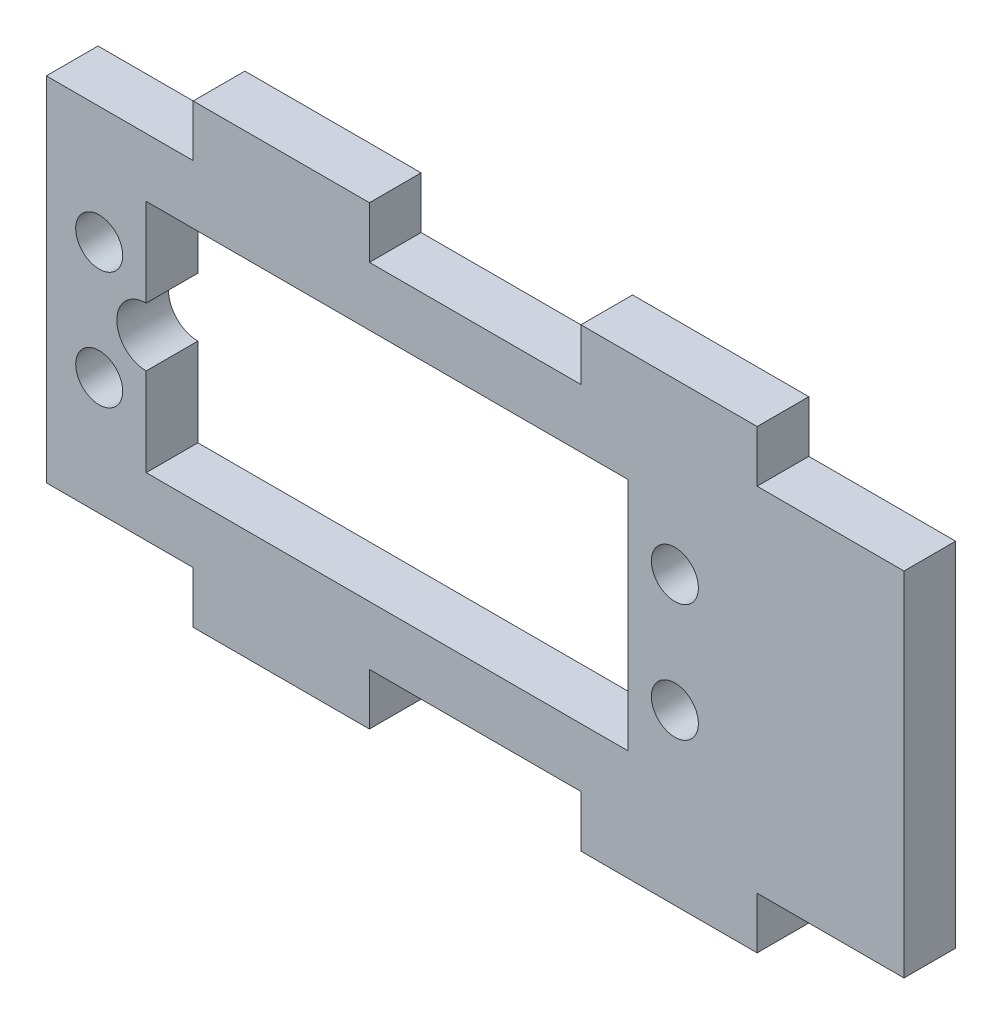
ISO-10303-21;
HEADER;
FILE_DESCRIPTION(('STEP AP214'),'2;1');
FILE_NAME('part.step','',(''),(''),'','','');
FILE_SCHEMA(('AUTOMOTIVE_DESIGN { 1 0 10303 214 1 1 1 1 }'));
ENDSEC;
DATA;
#1=APPLICATION_CONTEXT('core data for automotive mechanical design processes');
#2=APPLICATION_PROTOCOL_DEFINITION('international standard','automotive_design',2000,#1);
#3=PRODUCT_CONTEXT('',#1,'mechanical');
#4=PRODUCT('Part','Part','',(#3));
#5=PRODUCT_RELATED_PRODUCT_CATEGORY('part','',(#4));
#6=PRODUCT_DEFINITION_FORMATION('','',#4);
#7=PRODUCT_DEFINITION_CONTEXT('part definition',#1,'design');
#8=PRODUCT_DEFINITION('design','',#6,#7);
#9=PRODUCT_DEFINITION_SHAPE('','',#8);
#10=(LENGTH_UNIT() NAMED_UNIT(*) SI_UNIT(.MILLI.,.METRE.));
#11=(NAMED_UNIT(*) PLANE_ANGLE_UNIT() SI_UNIT($,.RADIAN.));
#12=(NAMED_UNIT(*) SI_UNIT($,.STERADIAN.) SOLID_ANGLE_UNIT());
#13=UNCERTAINTY_MEASURE_WITH_UNIT(LENGTH_MEASURE(1.E-05),#10,'distance_accuracy_value','');
#14=(GEOMETRIC_REPRESENTATION_CONTEXT(3) GLOBAL_UNCERTAINTY_ASSIGNED_CONTEXT((#13)) GLOBAL_UNIT_ASSIGNED_CONTEXT((#10,
#11,#12)) REPRESENTATION_CONTEXT('',''));
#15=CARTESIAN_POINT('',(0.,0.,0.));
#16=DIRECTION('',(0.,0.,1.));
#17=DIRECTION('',(1.,0.,0.));
#18=AXIS2_PLACEMENT_3D('',#15,#16,#17);
#19=CARTESIAN_POINT('',(-28.,9.99999999999999,4.4));
#20=DIRECTION('',(1.,0.,0.));
#21=DIRECTION('',(0.,1.,0.));
#22=AXIS2_PLACEMENT_3D('',#19,#20,#21);
#23=PLANE('',#22);
#24=DIRECTION('',(0.,0.,1.));
#25=VECTOR('',#24,1.);
#26=CARTESIAN_POINT('',(-28.,2.5,0.));
#27=LINE('',#26,#25);
#28=CARTESIAN_POINT('',(-28.,2.5,0.));
#29=VERTEX_POINT('',#28);
#30=CARTESIAN_POINT('',(-28.,2.5,4.4));
#31=VERTEX_POINT('',#30);
#32=EDGE_CURVE('E11',#29,#31,#27,.T.);
#33=ORIENTED_EDGE('',*,*,#32,.F.);
#34=DIRECTION('',(0.,-1.,0.));
#35=VECTOR('',#34,1.);
#36=CARTESIAN_POINT('',(-28.,9.99999999999999,0.));
#37=LINE('',#36,#35);
#38=CARTESIAN_POINT('',(-28.,9.99999999999999,0.));
#39=VERTEX_POINT('',#38);
#40=EDGE_CURVE('E236',#39,#29,#37,.T.);
#41=ORIENTED_EDGE('',*,*,#40,.F.);
#42=DIRECTION('',(0.,0.,-1.));
#43=VECTOR('',#42,1.);
#44=CARTESIAN_POINT('',(-28.,9.99999999999999,4.4));
#45=LINE('',#44,#43);
#46=CARTESIAN_POINT('',(-28.,9.99999999999999,4.4));
#47=VERTEX_POINT('',#46);
#48=EDGE_CURVE('E223',#47,#39,#45,.T.);
#49=ORIENTED_EDGE('',*,*,#48,.F.);
#50=DIRECTION('',(0.,-1.,0.));
#51=VECTOR('',#50,1.);
#52=CARTESIAN_POINT('',(-28.,9.99999999999999,4.4));
#53=LINE('',#52,#51);
#54=EDGE_CURVE('E217',#47,#31,#53,.T.);
#55=ORIENTED_EDGE('',*,*,#54,.T.);
#56=EDGE_LOOP('',(#33,#41,#49,#55));
#57=FACE_BOUND('',#56,.T.);
#58=ADVANCED_FACE('F35',(#57),#23,.T.);
#59=CARTESIAN_POINT('',(0.,0.,4.4));
#60=DIRECTION('',(0.,0.,-1.));
#61=DIRECTION('',(-1.,0.,0.));
#62=AXIS2_PLACEMENT_3D('',#59,#60,#61);
#63=PLANE('',#62);
#64=DIRECTION('',(0.,1.,0.));
#65=VECTOR('',#64,1.);
#66=CARTESIAN_POINT('',(-9.,-15.,4.4));
#67=LINE('',#66,#65);
#68=CARTESIAN_POINT('',(-9.,-19.4,4.4));
#69=VERTEX_POINT('',#68);
#70=CARTESIAN_POINT('',(-9.,-15.,4.4));
#71=VERTEX_POINT('',#70);
#72=EDGE_CURVE('E255',#69,#71,#67,.T.);
#73=ORIENTED_EDGE('',*,*,#72,.T.);
#74=DIRECTION('',(1.,0.,0.));
#75=VECTOR('',#74,1.);
#76=CARTESIAN_POINT('',(-9.,-15.,4.4));
#77=LINE('',#76,#75);
#78=CARTESIAN_POINT('',(9.,-15.,4.4));
#79=VERTEX_POINT('',#78);
#80=EDGE_CURVE('E258',#71,#79,#77,.T.);
#81=ORIENTED_EDGE('',*,*,#80,.T.);
#82=DIRECTION('',(0.,-1.,0.));
#83=VECTOR('',#82,1.);
#84=CARTESIAN_POINT('',(9.,-15.,4.4));
#85=LINE('',#84,#83);
#86=CARTESIAN_POINT('',(9.,-19.4,4.4));
#87=VERTEX_POINT('',#86);
#88=EDGE_CURVE('E261',#79,#87,#85,.T.);
#89=ORIENTED_EDGE('',*,*,#88,.T.);
#90=DIRECTION('',(1.,0.,0.));
#91=VECTOR('',#90,1.);
#92=CARTESIAN_POINT('',(9.,-19.4,4.4));
#93=LINE('',#92,#91);
#94=CARTESIAN_POINT('',(24.,-19.4,4.4));
#95=VERTEX_POINT('',#94);
#96=EDGE_CURVE('E263',#87,#95,#93,.T.);
#97=ORIENTED_EDGE('',*,*,#96,.T.);
#98=DIRECTION('',(0.,1.,0.));
#99=VECTOR('',#98,1.);
#100=CARTESIAN_POINT('',(24.,-19.4,4.4));
#101=LINE('',#100,#99);
#102=CARTESIAN_POINT('',(24.,-15.,4.4));
#103=VERTEX_POINT('',#102);
#104=EDGE_CURVE('E265',#95,#103,#101,.T.);
#105=ORIENTED_EDGE('',*,*,#104,.T.);
#106=DIRECTION('',(1.,0.,0.));
#107=VECTOR('',#106,1.);
#108=CARTESIAN_POINT('',(24.,-15.,4.4));
#109=LINE('',#108,#107);
#110=CARTESIAN_POINT('',(36.5,-15.,4.4));
#111=VERTEX_POINT('',#110);
#112=EDGE_CURVE('E267',#103,#111,#109,.T.);
#113=ORIENTED_EDGE('',*,*,#112,.T.);
#114=DIRECTION('',(0.,1.,0.));
#115=VECTOR('',#114,1.);
#116=CARTESIAN_POINT('',(36.5,-15.,4.4));
#117=LINE('',#116,#115);
#118=CARTESIAN_POINT('',(36.5,15.,4.4));
#119=VERTEX_POINT('',#118);
#120=EDGE_CURVE('E269',#111,#119,#117,.T.);
#121=ORIENTED_EDGE('',*,*,#120,.T.);
#122=DIRECTION('',(-1.,0.,0.));
#123=VECTOR('',#122,1.);
#124=CARTESIAN_POINT('',(24.,15.,4.4));
#125=LINE('',#124,#123);
#126=CARTESIAN_POINT('',(24.,15.,4.4));
#127=VERTEX_POINT('',#126);
#128=EDGE_CURVE('E271',#119,#127,#125,.T.);
#129=ORIENTED_EDGE('',*,*,#128,.T.);
#130=DIRECTION('',(0.,1.,0.));
#131=VECTOR('',#130,1.);
#132=CARTESIAN_POINT('',(24.,19.4,4.4));
#133=LINE('',#132,#131);
#134=CARTESIAN_POINT('',(24.,19.4,4.4));
#135=VERTEX_POINT('',#134);
#136=EDGE_CURVE('E273',#127,#135,#133,.T.);
#137=ORIENTED_EDGE('',*,*,#136,.T.);
#138=DIRECTION('',(-1.,0.,0.));
#139=VECTOR('',#138,1.);
#140=CARTESIAN_POINT('',(9.,19.4,4.4));
#141=LINE('',#140,#139);
#142=CARTESIAN_POINT('',(9.,19.4,4.4));
#143=VERTEX_POINT('',#142);
#144=EDGE_CURVE('E275',#135,#143,#141,.T.);
#145=ORIENTED_EDGE('',*,*,#144,.T.);
#146=DIRECTION('',(0.,-1.,0.));
#147=VECTOR('',#146,1.);
#148=CARTESIAN_POINT('',(9.,15.,4.4));
#149=LINE('',#148,#147);
#150=CARTESIAN_POINT('',(9.,15.,4.4));
#151=VERTEX_POINT('',#150);
#152=EDGE_CURVE('E277',#143,#151,#149,.T.);
#153=ORIENTED_EDGE('',*,*,#152,.T.);
#154=DIRECTION('',(-1.,0.,0.));
#155=VECTOR('',#154,1.);
#156=CARTESIAN_POINT('',(-9.,15.,4.4));
#157=LINE('',#156,#155);
#158=CARTESIAN_POINT('',(-9.,15.,4.4));
#159=VERTEX_POINT('',#158);
#160=EDGE_CURVE('E279',#151,#159,#157,.T.);
#161=ORIENTED_EDGE('',*,*,#160,.T.);
#162=DIRECTION('',(0.,1.,0.));
#163=VECTOR('',#162,1.);
#164=CARTESIAN_POINT('',(-9.,15.,4.4));
#165=LINE('',#164,#163);
#166=CARTESIAN_POINT('',(-9.,19.4,4.4));
#167=VERTEX_POINT('',#166);
#168=EDGE_CURVE('E281',#159,#167,#165,.T.);
#169=ORIENTED_EDGE('',*,*,#168,.T.);
#170=DIRECTION('',(-1.,0.,0.));
#171=VECTOR('',#170,1.);
#172=CARTESIAN_POINT('',(-9.,19.4,4.4));
#173=LINE('',#172,#171);
#174=CARTESIAN_POINT('',(-24.,19.4,4.4));
#175=VERTEX_POINT('',#174);
#176=EDGE_CURVE('E283',#167,#175,#173,.T.);
#177=ORIENTED_EDGE('',*,*,#176,.T.);
#178=DIRECTION('',(0.,-1.,0.));
#179=VECTOR('',#178,1.);
#180=CARTESIAN_POINT('',(-24.,19.4,4.4));
#181=LINE('',#180,#179);
#182=CARTESIAN_POINT('',(-24.,15.,4.4));
#183=VERTEX_POINT('',#182);
#184=EDGE_CURVE('E285',#175,#183,#181,.T.);
#185=ORIENTED_EDGE('',*,*,#184,.T.);
#186=DIRECTION('',(-1.,0.,0.));
#187=VECTOR('',#186,1.);
#188=CARTESIAN_POINT('',(-24.,15.,4.4));
#189=LINE('',#188,#187);
#190=CARTESIAN_POINT('',(-36.5,15.,4.4));
#191=VERTEX_POINT('',#190);
#192=EDGE_CURVE('E287',#183,#191,#189,.T.);
#193=ORIENTED_EDGE('',*,*,#192,.T.);
#194=DIRECTION('',(0.,-1.,0.));
#195=VECTOR('',#194,1.);
#196=CARTESIAN_POINT('',(-36.5,-15.,4.4));
#197=LINE('',#196,#195);
#198=CARTESIAN_POINT('',(-36.5,-15.,4.4));
#199=VERTEX_POINT('',#198);
#200=EDGE_CURVE('E289',#191,#199,#197,.T.);
#201=ORIENTED_EDGE('',*,*,#200,.T.);
#202=DIRECTION('',(1.,0.,0.));
#203=VECTOR('',#202,1.);
#204=CARTESIAN_POINT('',(-24.,-15.,4.4));
#205=LINE('',#204,#203);
#206=CARTESIAN_POINT('',(-24.,-15.,4.4));
#207=VERTEX_POINT('',#206);
#208=EDGE_CURVE('E291',#199,#207,#205,.T.);
#209=ORIENTED_EDGE('',*,*,#208,.T.);
#210=DIRECTION('',(0.,-1.,0.));
#211=VECTOR('',#210,1.);
#212=CARTESIAN_POINT('',(-24.,-19.4,4.4));
#213=LINE('',#212,#211);
#214=CARTESIAN_POINT('',(-24.,-19.4,4.4));
#215=VERTEX_POINT('',#214);
#216=EDGE_CURVE('E293',#207,#215,#213,.T.);
#217=ORIENTED_EDGE('',*,*,#216,.T.);
#218=DIRECTION('',(1.,0.,0.));
#219=VECTOR('',#218,1.);
#220=CARTESIAN_POINT('',(-9.,-19.4,4.4));
#221=LINE('',#220,#219);
#222=EDGE_CURVE('E295',#215,#69,#221,.T.);
#223=ORIENTED_EDGE('',*,*,#222,.T.);
#224=EDGE_LOOP('',(#73,#81,#89,#97,#105,#113,#121,#129,#137,#145,#153,#161,#169,#177,#185,#193,
#201,#209,#217,#223));
#225=FACE_BOUND('',#224,.T.);
#226=CARTESIAN_POINT('',(-28.,-2.5,4.4));
#227=VERTEX_POINT('',#226);
#228=CARTESIAN_POINT('',(-28.,-10.,4.4));
#229=VERTEX_POINT('',#228);
#230=EDGE_CURVE('E219',#227,#229,#53,.T.);
#231=ORIENTED_EDGE('',*,*,#230,.F.);
#232=CARTESIAN_POINT('',(-28.,0.,4.4));
#233=DIRECTION('',(0.,0.,1.));
#234=DIRECTION('',(1.,0.,0.));
#235=AXIS2_PLACEMENT_3D('',#232,#233,#234);
#236=CIRCLE('',#235,2.5);
#237=EDGE_CURVE('E49',#31,#227,#236,.T.);
#238=ORIENTED_EDGE('',*,*,#237,.F.);
#239=ORIENTED_EDGE('',*,*,#54,.F.);
#240=DIRECTION('',(-1.,0.,0.));
#241=VECTOR('',#240,1.);
#242=CARTESIAN_POINT('',(13.,10.,4.4));
#243=LINE('',#242,#241);
#244=CARTESIAN_POINT('',(13.,10.,4.4));
#245=VERTEX_POINT('',#244);
#246=EDGE_CURVE('E234',#245,#47,#243,.T.);
#247=ORIENTED_EDGE('',*,*,#246,.F.);
#248=DIRECTION('',(0.,1.,0.));
#249=VECTOR('',#248,1.);
#250=CARTESIAN_POINT('',(13.,10.,4.4));
#251=LINE('',#250,#249);
#252=CARTESIAN_POINT('',(13.,-10.,4.4));
#253=VERTEX_POINT('',#252);
#254=EDGE_CURVE('E226',#253,#245,#251,.T.);
#255=ORIENTED_EDGE('',*,*,#254,.F.);
#256=DIRECTION('',(1.,0.,0.));
#257=VECTOR('',#256,1.);
#258=CARTESIAN_POINT('',(13.,-10.,4.4));
#259=LINE('',#258,#257);
#260=EDGE_CURVE('E224',#229,#253,#259,.T.);
#261=ORIENTED_EDGE('',*,*,#260,.F.);
#262=EDGE_LOOP('',(#231,#238,#239,#247,#255,#261));
#263=FACE_BOUND('',#262,.T.);
#264=CARTESIAN_POINT('',(-32.,5.,4.4));
#265=DIRECTION('',(0.,0.,1.));
#266=DIRECTION('',(1.,0.,0.));
#267=AXIS2_PLACEMENT_3D('',#264,#265,#266);
#268=CIRCLE('',#267,2.);
#269=CARTESIAN_POINT('',(-30.,5.,4.4));
#270=VERTEX_POINT('',#269);
#271=EDGE_CURVE('E405',#270,#270,#268,.T.);
#272=ORIENTED_EDGE('',*,*,#271,.F.);
#273=EDGE_LOOP('',(#272));
#274=FACE_BOUND('',#273,.T.);
#275=CARTESIAN_POINT('',(-32.,-5.,4.4));
#276=DIRECTION('',(0.,0.,1.));
#277=DIRECTION('',(-1.,0.,0.));
#278=AXIS2_PLACEMENT_3D('',#275,#276,#277);
#279=CIRCLE('',#278,2.);
#280=CARTESIAN_POINT('',(-34.,-5.,4.4));
#281=VERTEX_POINT('',#280);
#282=EDGE_CURVE('E410',#281,#281,#279,.T.);
#283=ORIENTED_EDGE('',*,*,#282,.F.);
#284=EDGE_LOOP('',(#283));
#285=FACE_BOUND('',#284,.T.);
#286=CARTESIAN_POINT('',(17.,-4.99999999999999,4.4));
#287=DIRECTION('',(0.,0.,1.));
#288=DIRECTION('',(1.,0.,0.));
#289=AXIS2_PLACEMENT_3D('',#286,#287,#288);
#290=CIRCLE('',#289,2.);
#291=CARTESIAN_POINT('',(19.,-4.99999999999999,4.4));
#292=VERTEX_POINT('',#291);
#293=EDGE_CURVE('E415',#292,#292,#290,.T.);
#294=ORIENTED_EDGE('',*,*,#293,.F.);
#295=EDGE_LOOP('',(#294));
#296=FACE_BOUND('',#295,.T.);
#297=CARTESIAN_POINT('',(17.,4.99999999999999,4.4));
#298=DIRECTION('',(0.,0.,1.));
#299=DIRECTION('',(-1.,0.,0.));
#300=AXIS2_PLACEMENT_3D('',#297,#298,#299);
#301=CIRCLE('',#300,2.);
#302=CARTESIAN_POINT('',(15.,4.99999999999999,4.4));
#303=VERTEX_POINT('',#302);
#304=EDGE_CURVE('E421',#303,#303,#301,.T.);
#305=ORIENTED_EDGE('',*,*,#304,.F.);
#306=EDGE_LOOP('',(#305));
#307=FACE_BOUND('',#306,.T.);
#308=ADVANCED_FACE('F214',(#225,#263,#274,#285,#296,#307),#63,.F.);
#309=CARTESIAN_POINT('',(0.,0.,0.));
#310=DIRECTION('',(0.,0.,-1.));
#311=DIRECTION('',(-1.,0.,0.));
#312=AXIS2_PLACEMENT_3D('',#309,#310,#311);
#313=PLANE('',#312);
#314=CARTESIAN_POINT('',(-28.,0.,0.));
#315=DIRECTION('',(0.,0.,1.));
#316=DIRECTION('',(1.,0.,0.));
#317=AXIS2_PLACEMENT_3D('',#314,#315,#316);
#318=CIRCLE('',#317,2.5);
#319=CARTESIAN_POINT('',(-28.,-2.5,0.));
#320=VERTEX_POINT('',#319);
#321=EDGE_CURVE('E207',#29,#320,#318,.T.);
#322=ORIENTED_EDGE('',*,*,#321,.T.);
#323=CARTESIAN_POINT('',(-28.,-10.,0.));
#324=VERTEX_POINT('',#323);
#325=EDGE_CURVE('E239',#320,#324,#37,.T.);
#326=ORIENTED_EDGE('',*,*,#325,.T.);
#327=DIRECTION('',(1.,0.,0.));
#328=VECTOR('',#327,1.);
#329=CARTESIAN_POINT('',(13.,-10.,0.));
#330=LINE('',#329,#328);
#331=CARTESIAN_POINT('',(13.,-10.,0.));
#332=VERTEX_POINT('',#331);
#333=EDGE_CURVE('E238',#324,#332,#330,.T.);
#334=ORIENTED_EDGE('',*,*,#333,.T.);
#335=DIRECTION('',(0.,1.,0.));
#336=VECTOR('',#335,1.);
#337=CARTESIAN_POINT('',(13.,10.,0.));
#338=LINE('',#337,#336);
#339=CARTESIAN_POINT('',(13.,10.,0.));
#340=VERTEX_POINT('',#339);
#341=EDGE_CURVE('E242',#332,#340,#338,.T.);
#342=ORIENTED_EDGE('',*,*,#341,.T.);
#343=DIRECTION('',(-1.,0.,0.));
#344=VECTOR('',#343,1.);
#345=CARTESIAN_POINT('',(13.,10.,0.));
#346=LINE('',#345,#344);
#347=EDGE_CURVE('E228',#340,#39,#346,.T.);
#348=ORIENTED_EDGE('',*,*,#347,.T.);
#349=ORIENTED_EDGE('',*,*,#40,.T.);
#350=EDGE_LOOP('',(#322,#326,#334,#342,#348,#349));
#351=FACE_BOUND('',#350,.T.);
#352=CARTESIAN_POINT('',(17.,-4.99999999999999,0.));
#353=DIRECTION('',(0.,0.,1.));
#354=DIRECTION('',(1.,0.,0.));
#355=AXIS2_PLACEMENT_3D('',#352,#353,#354);
#356=CIRCLE('',#355,2.);
#357=CARTESIAN_POINT('',(19.,-4.99999999999999,0.));
#358=VERTEX_POINT('',#357);
#359=EDGE_CURVE('E418',#358,#358,#356,.T.);
#360=ORIENTED_EDGE('',*,*,#359,.T.);
#361=EDGE_LOOP('',(#360));
#362=FACE_BOUND('',#361,.T.);
#363=CARTESIAN_POINT('',(-32.,5.,0.));
#364=DIRECTION('',(0.,0.,1.));
#365=DIRECTION('',(1.,0.,0.));
#366=AXIS2_PLACEMENT_3D('',#363,#364,#365);
#367=CIRCLE('',#366,2.);
#368=CARTESIAN_POINT('',(-30.,5.,0.));
#369=VERTEX_POINT('',#368);
#370=EDGE_CURVE('E230',#369,#369,#367,.T.);
#371=ORIENTED_EDGE('',*,*,#370,.T.);
#372=EDGE_LOOP('',(#371));
#373=FACE_BOUND('',#372,.T.);
#374=DIRECTION('',(0.,1.,0.));
#375=VECTOR('',#374,1.);
#376=CARTESIAN_POINT('',(-9.,-15.,0.));
#377=LINE('',#376,#375);
#378=CARTESIAN_POINT('',(-9.,-19.4,0.));
#379=VERTEX_POINT('',#378);
#380=CARTESIAN_POINT('',(-9.,-15.,0.));
#381=VERTEX_POINT('',#380);
#382=EDGE_CURVE('E254',#379,#381,#377,.T.);
#383=ORIENTED_EDGE('',*,*,#382,.F.);
#384=DIRECTION('',(1.,0.,0.));
#385=VECTOR('',#384,1.);
#386=CARTESIAN_POINT('',(-9.,-19.4,0.));
#387=LINE('',#386,#385);
#388=CARTESIAN_POINT('',(-24.,-19.4,0.));
#389=VERTEX_POINT('',#388);
#390=EDGE_CURVE('E259',#389,#379,#387,.T.);
#391=ORIENTED_EDGE('',*,*,#390,.F.);
#392=DIRECTION('',(0.,-1.,0.));
#393=VECTOR('',#392,1.);
#394=CARTESIAN_POINT('',(-24.,-19.4,0.));
#395=LINE('',#394,#393);
#396=CARTESIAN_POINT('',(-24.,-15.,0.));
#397=VERTEX_POINT('',#396);
#398=EDGE_CURVE('E334',#397,#389,#395,.T.);
#399=ORIENTED_EDGE('',*,*,#398,.F.);
#400=DIRECTION('',(1.,0.,0.));
#401=VECTOR('',#400,1.);
#402=CARTESIAN_POINT('',(-24.,-15.,0.));
#403=LINE('',#402,#401);
#404=CARTESIAN_POINT('',(-36.5,-15.,0.));
#405=VERTEX_POINT('',#404);
#406=EDGE_CURVE('E332',#405,#397,#403,.T.);
#407=ORIENTED_EDGE('',*,*,#406,.F.);
#408=DIRECTION('',(0.,-1.,0.));
#409=VECTOR('',#408,1.);
#410=CARTESIAN_POINT('',(-36.5,-15.,0.));
#411=LINE('',#410,#409);
#412=CARTESIAN_POINT('',(-36.5,15.,0.));
#413=VERTEX_POINT('',#412);
#414=EDGE_CURVE('E330',#413,#405,#411,.T.);
#415=ORIENTED_EDGE('',*,*,#414,.F.);
#416=DIRECTION('',(-1.,0.,0.));
#417=VECTOR('',#416,1.);
#418=CARTESIAN_POINT('',(-24.,15.,0.));
#419=LINE('',#418,#417);
#420=CARTESIAN_POINT('',(-24.,15.,0.));
#421=VERTEX_POINT('',#420);
#422=EDGE_CURVE('E328',#421,#413,#419,.T.);
#423=ORIENTED_EDGE('',*,*,#422,.F.);
#424=DIRECTION('',(0.,-1.,0.));
#425=VECTOR('',#424,1.);
#426=CARTESIAN_POINT('',(-24.,19.4,0.));
#427=LINE('',#426,#425);
#428=CARTESIAN_POINT('',(-24.,19.4,0.));
#429=VERTEX_POINT('',#428);
#430=EDGE_CURVE('E326',#429,#421,#427,.T.);
#431=ORIENTED_EDGE('',*,*,#430,.F.);
#432=DIRECTION('',(-1.,0.,0.));
#433=VECTOR('',#432,1.);
#434=CARTESIAN_POINT('',(-9.,19.4,0.));
#435=LINE('',#434,#433);
#436=CARTESIAN_POINT('',(-9.,19.4,0.));
#437=VERTEX_POINT('',#436);
#438=EDGE_CURVE('E324',#437,#429,#435,.T.);
#439=ORIENTED_EDGE('',*,*,#438,.F.);
#440=DIRECTION('',(0.,1.,0.));
#441=VECTOR('',#440,1.);
#442=CARTESIAN_POINT('',(-9.,15.,0.));
#443=LINE('',#442,#441);
#444=CARTESIAN_POINT('',(-9.,15.,0.));
#445=VERTEX_POINT('',#444);
#446=EDGE_CURVE('E322',#445,#437,#443,.T.);
#447=ORIENTED_EDGE('',*,*,#446,.F.);
#448=DIRECTION('',(-1.,0.,0.));
#449=VECTOR('',#448,1.);
#450=CARTESIAN_POINT('',(-9.,15.,0.));
#451=LINE('',#450,#449);
#452=CARTESIAN_POINT('',(9.,15.,0.));
#453=VERTEX_POINT('',#452);
#454=EDGE_CURVE('E320',#453,#445,#451,.T.);
#455=ORIENTED_EDGE('',*,*,#454,.F.);
#456=DIRECTION('',(0.,-1.,0.));
#457=VECTOR('',#456,1.);
#458=CARTESIAN_POINT('',(9.,15.,0.));
#459=LINE('',#458,#457);
#460=CARTESIAN_POINT('',(9.,19.4,0.));
#461=VERTEX_POINT('',#460);
#462=EDGE_CURVE('E318',#461,#453,#459,.T.);
#463=ORIENTED_EDGE('',*,*,#462,.F.);
#464=DIRECTION('',(-1.,0.,0.));
#465=VECTOR('',#464,1.);
#466=CARTESIAN_POINT('',(9.,19.4,0.));
#467=LINE('',#466,#465);
#468=CARTESIAN_POINT('',(24.,19.4,0.));
#469=VERTEX_POINT('',#468);
#470=EDGE_CURVE('E316',#469,#461,#467,.T.);
#471=ORIENTED_EDGE('',*,*,#470,.F.);
#472=DIRECTION('',(0.,1.,0.));
#473=VECTOR('',#472,1.);
#474=CARTESIAN_POINT('',(24.,19.4,0.));
#475=LINE('',#474,#473);
#476=CARTESIAN_POINT('',(24.,15.,0.));
#477=VERTEX_POINT('',#476);
#478=EDGE_CURVE('E314',#477,#469,#475,.T.);
#479=ORIENTED_EDGE('',*,*,#478,.F.);
#480=DIRECTION('',(-1.,0.,0.));
#481=VECTOR('',#480,1.);
#482=CARTESIAN_POINT('',(24.,15.,0.));
#483=LINE('',#482,#481);
#484=CARTESIAN_POINT('',(36.5,15.,0.));
#485=VERTEX_POINT('',#484);
#486=EDGE_CURVE('E312',#485,#477,#483,.T.);
#487=ORIENTED_EDGE('',*,*,#486,.F.);
#488=DIRECTION('',(0.,1.,0.));
#489=VECTOR('',#488,1.);
#490=CARTESIAN_POINT('',(36.5,-15.,0.));
#491=LINE('',#490,#489);
#492=CARTESIAN_POINT('',(36.5,-15.,0.));
#493=VERTEX_POINT('',#492);
#494=EDGE_CURVE('E310',#493,#485,#491,.T.);
#495=ORIENTED_EDGE('',*,*,#494,.F.);
#496=DIRECTION('',(1.,0.,0.));
#497=VECTOR('',#496,1.);
#498=CARTESIAN_POINT('',(24.,-15.,0.));
#499=LINE('',#498,#497);
#500=CARTESIAN_POINT('',(24.,-15.,0.));
#501=VERTEX_POINT('',#500);
#502=EDGE_CURVE('E308',#501,#493,#499,.T.);
#503=ORIENTED_EDGE('',*,*,#502,.F.);
#504=DIRECTION('',(0.,1.,0.));
#505=VECTOR('',#504,1.);
#506=CARTESIAN_POINT('',(24.,-19.4,0.));
#507=LINE('',#506,#505);
#508=CARTESIAN_POINT('',(24.,-19.4,0.));
#509=VERTEX_POINT('',#508);
#510=EDGE_CURVE('E306',#509,#501,#507,.T.);
#511=ORIENTED_EDGE('',*,*,#510,.F.);
#512=DIRECTION('',(1.,0.,0.));
#513=VECTOR('',#512,1.);
#514=CARTESIAN_POINT('',(9.,-19.4,0.));
#515=LINE('',#514,#513);
#516=CARTESIAN_POINT('',(9.,-19.4,0.));
#517=VERTEX_POINT('',#516);
#518=EDGE_CURVE('E304',#517,#509,#515,.T.);
#519=ORIENTED_EDGE('',*,*,#518,.F.);
#520=DIRECTION('',(0.,-1.,0.));
#521=VECTOR('',#520,1.);
#522=CARTESIAN_POINT('',(9.,-15.,0.));
#523=LINE('',#522,#521);
#524=CARTESIAN_POINT('',(9.,-15.,0.));
#525=VERTEX_POINT('',#524);
#526=EDGE_CURVE('E302',#525,#517,#523,.T.);
#527=ORIENTED_EDGE('',*,*,#526,.F.);
#528=DIRECTION('',(1.,0.,0.));
#529=VECTOR('',#528,1.);
#530=CARTESIAN_POINT('',(-9.,-15.,0.));
#531=LINE('',#530,#529);
#532=EDGE_CURVE('E300',#381,#525,#531,.T.);
#533=ORIENTED_EDGE('',*,*,#532,.F.);
#534=EDGE_LOOP('',(#383,#391,#399,#407,#415,#423,#431,#439,#447,#455,#463,#471,#479,#487,#495,
#503,#511,#519,#527,#533));
#535=FACE_BOUND('',#534,.T.);
#536=CARTESIAN_POINT('',(-32.,-5.,0.));
#537=DIRECTION('',(0.,0.,1.));
#538=DIRECTION('',(-1.,0.,0.));
#539=AXIS2_PLACEMENT_3D('',#536,#537,#538);
#540=CIRCLE('',#539,2.);
#541=CARTESIAN_POINT('',(-34.,-5.,0.));
#542=VERTEX_POINT('',#541);
#543=EDGE_CURVE('E412',#542,#542,#540,.T.);
#544=ORIENTED_EDGE('',*,*,#543,.T.);
#545=EDGE_LOOP('',(#544));
#546=FACE_BOUND('',#545,.T.);
#547=CARTESIAN_POINT('',(17.,4.99999999999999,0.));
#548=DIRECTION('',(0.,0.,1.));
#549=DIRECTION('',(-1.,0.,0.));
#550=AXIS2_PLACEMENT_3D('',#547,#548,#549);
#551=CIRCLE('',#550,2.);
#552=CARTESIAN_POINT('',(15.,4.99999999999999,0.));
#553=VERTEX_POINT('',#552);
#554=EDGE_CURVE('E401',#553,#553,#551,.T.);
#555=ORIENTED_EDGE('',*,*,#554,.T.);
#556=EDGE_LOOP('',(#555));
#557=FACE_BOUND('',#556,.T.);
#558=ADVANCED_FACE('F398',(#351,#362,#373,#535,#546,#557),#313,.T.);
#559=CARTESIAN_POINT('',(-9.,-15.,4.4));
#560=DIRECTION('',(-1.,0.,0.));
#561=DIRECTION('',(0.,0.,1.));
#562=AXIS2_PLACEMENT_3D('',#559,#560,#561);
#563=PLANE('',#562);
#564=ORIENTED_EDGE('',*,*,#382,.T.);
#565=DIRECTION('',(0.,0.,-1.));
#566=VECTOR('',#565,1.);
#567=CARTESIAN_POINT('',(-9.,-15.,4.4));
#568=LINE('',#567,#566);
#569=EDGE_CURVE('E393',#71,#381,#568,.T.);
#570=ORIENTED_EDGE('',*,*,#569,.F.);
#571=ORIENTED_EDGE('',*,*,#72,.F.);
#572=DIRECTION('',(0.,0.,-1.));
#573=VECTOR('',#572,1.);
#574=CARTESIAN_POINT('',(-9.,-19.4,4.4));
#575=LINE('',#574,#573);
#576=EDGE_CURVE('E297',#69,#379,#575,.T.);
#577=ORIENTED_EDGE('',*,*,#576,.T.);
#578=EDGE_LOOP('',(#564,#570,#571,#577));
#579=FACE_BOUND('',#578,.T.);
#580=ADVANCED_FACE('F37',(#579),#563,.F.);
#581=CARTESIAN_POINT('',(-9.,-15.,4.4));
#582=DIRECTION('',(0.,1.,0.));
#583=DIRECTION('',(0.,0.,1.));
#584=AXIS2_PLACEMENT_3D('',#581,#582,#583);
#585=PLANE('',#584);
#586=ORIENTED_EDGE('',*,*,#532,.T.);
#587=DIRECTION('',(0.,0.,-1.));
#588=VECTOR('',#587,1.);
#589=CARTESIAN_POINT('',(9.,-15.,4.4));
#590=LINE('',#589,#588);
#591=EDGE_CURVE('E390',#79,#525,#590,.T.);
#592=ORIENTED_EDGE('',*,*,#591,.F.);
#593=ORIENTED_EDGE('',*,*,#80,.F.);
#594=ORIENTED_EDGE('',*,*,#569,.T.);
#595=EDGE_LOOP('',(#586,#592,#593,#594));
#596=FACE_BOUND('',#595,.T.);
#597=ADVANCED_FACE('F513',(#596),#585,.F.);
#598=CARTESIAN_POINT('',(9.,-15.,4.4));
#599=DIRECTION('',(1.,0.,0.));
#600=DIRECTION('',(0.,0.,-1.));
#601=AXIS2_PLACEMENT_3D('',#598,#599,#600);
#602=PLANE('',#601);
#603=ORIENTED_EDGE('',*,*,#526,.T.);
#604=DIRECTION('',(0.,0.,-1.));
#605=VECTOR('',#604,1.);
#606=CARTESIAN_POINT('',(9.,-19.4,4.4));
#607=LINE('',#606,#605);
#608=EDGE_CURVE('E387',#87,#517,#607,.T.);
#609=ORIENTED_EDGE('',*,*,#608,.F.);
#610=ORIENTED_EDGE('',*,*,#88,.F.);
#611=ORIENTED_EDGE('',*,*,#591,.T.);
#612=EDGE_LOOP('',(#603,#609,#610,#611));
#613=FACE_BOUND('',#612,.T.);
#614=ADVANCED_FACE('F510',(#613),#602,.F.);
#615=CARTESIAN_POINT('',(9.,-19.4,4.4));
#616=DIRECTION('',(0.,1.,0.));
#617=DIRECTION('',(0.,0.,1.));
#618=AXIS2_PLACEMENT_3D('',#615,#616,#617);
#619=PLANE('',#618);
#620=ORIENTED_EDGE('',*,*,#518,.T.);
#621=DIRECTION('',(0.,0.,-1.));
#622=VECTOR('',#621,1.);
#623=CARTESIAN_POINT('',(24.,-19.4,4.4));
#624=LINE('',#623,#622);
#625=EDGE_CURVE('E384',#95,#509,#624,.T.);
#626=ORIENTED_EDGE('',*,*,#625,.F.);
#627=ORIENTED_EDGE('',*,*,#96,.F.);
#628=ORIENTED_EDGE('',*,*,#608,.T.);
#629=EDGE_LOOP('',(#620,#626,#627,#628));
#630=FACE_BOUND('',#629,.T.);
#631=ADVANCED_FACE('F506',(#630),#619,.F.);
#632=CARTESIAN_POINT('',(24.,-19.4,4.4));
#633=DIRECTION('',(-1.,0.,0.));
#634=DIRECTION('',(0.,0.,1.));
#635=AXIS2_PLACEMENT_3D('',#632,#633,#634);
#636=PLANE('',#635);
#637=ORIENTED_EDGE('',*,*,#510,.T.);
#638=DIRECTION('',(0.,0.,-1.));
#639=VECTOR('',#638,1.);
#640=CARTESIAN_POINT('',(24.,-15.,4.4));
#641=LINE('',#640,#639);
#642=EDGE_CURVE('E381',#103,#501,#641,.T.);
#643=ORIENTED_EDGE('',*,*,#642,.F.);
#644=ORIENTED_EDGE('',*,*,#104,.F.);
#645=ORIENTED_EDGE('',*,*,#625,.T.);
#646=EDGE_LOOP('',(#637,#643,#644,#645));
#647=FACE_BOUND('',#646,.T.);
#648=ADVANCED_FACE('F502',(#647),#636,.F.);
#649=CARTESIAN_POINT('',(24.,-15.,4.4));
#650=DIRECTION('',(0.,1.,0.));
#651=DIRECTION('',(0.,0.,1.));
#652=AXIS2_PLACEMENT_3D('',#649,#650,#651);
#653=PLANE('',#652);
#654=ORIENTED_EDGE('',*,*,#502,.T.);
#655=DIRECTION('',(0.,0.,-1.));
#656=VECTOR('',#655,1.);
#657=CARTESIAN_POINT('',(36.5,-15.,4.4));
#658=LINE('',#657,#656);
#659=EDGE_CURVE('E378',#111,#493,#658,.T.);
#660=ORIENTED_EDGE('',*,*,#659,.F.);
#661=ORIENTED_EDGE('',*,*,#112,.F.);
#662=ORIENTED_EDGE('',*,*,#642,.T.);
#663=EDGE_LOOP('',(#654,#660,#661,#662));
#664=FACE_BOUND('',#663,.T.);
#665=ADVANCED_FACE('F498',(#664),#653,.F.);
#666=CARTESIAN_POINT('',(36.5,-15.,4.4));
#667=DIRECTION('',(-1.,0.,0.));
#668=DIRECTION('',(0.,0.,1.));
#669=AXIS2_PLACEMENT_3D('',#666,#667,#668);
#670=PLANE('',#669);
#671=ORIENTED_EDGE('',*,*,#494,.T.);
#672=DIRECTION('',(0.,0.,-1.));
#673=VECTOR('',#672,1.);
#674=CARTESIAN_POINT('',(36.5,15.,4.4));
#675=LINE('',#674,#673);
#676=EDGE_CURVE('E375',#119,#485,#675,.T.);
#677=ORIENTED_EDGE('',*,*,#676,.F.);
#678=ORIENTED_EDGE('',*,*,#120,.F.);
#679=ORIENTED_EDGE('',*,*,#659,.T.);
#680=EDGE_LOOP('',(#671,#677,#678,#679));
#681=FACE_BOUND('',#680,.T.);
#682=ADVANCED_FACE('F494',(#681),#670,.F.);
#683=CARTESIAN_POINT('',(24.,15.,4.4));
#684=DIRECTION('',(0.,-1.,0.));
#685=DIRECTION('',(0.,0.,-1.));
#686=AXIS2_PLACEMENT_3D('',#683,#684,#685);
#687=PLANE('',#686);
#688=ORIENTED_EDGE('',*,*,#486,.T.);
#689=DIRECTION('',(0.,0.,-1.));
#690=VECTOR('',#689,1.);
#691=CARTESIAN_POINT('',(24.,15.,4.4));
#692=LINE('',#691,#690);
#693=EDGE_CURVE('E372',#127,#477,#692,.T.);
#694=ORIENTED_EDGE('',*,*,#693,.F.);
#695=ORIENTED_EDGE('',*,*,#128,.F.);
#696=ORIENTED_EDGE('',*,*,#676,.T.);
#697=EDGE_LOOP('',(#688,#694,#695,#696));
#698=FACE_BOUND('',#697,.T.);
#699=ADVANCED_FACE('F490',(#698),#687,.F.);
#700=CARTESIAN_POINT('',(24.,19.4,4.4));
#701=DIRECTION('',(-1.,0.,0.));
#702=DIRECTION('',(0.,0.,1.));
#703=AXIS2_PLACEMENT_3D('',#700,#701,#702);
#704=PLANE('',#703);
#705=ORIENTED_EDGE('',*,*,#478,.T.);
#706=DIRECTION('',(0.,0.,-1.));
#707=VECTOR('',#706,1.);
#708=CARTESIAN_POINT('',(24.,19.4,4.4));
#709=LINE('',#708,#707);
#710=EDGE_CURVE('E369',#135,#469,#709,.T.);
#711=ORIENTED_EDGE('',*,*,#710,.F.);
#712=ORIENTED_EDGE('',*,*,#136,.F.);
#713=ORIENTED_EDGE('',*,*,#693,.T.);
#714=EDGE_LOOP('',(#705,#711,#712,#713));
#715=FACE_BOUND('',#714,.T.);
#716=ADVANCED_FACE('F486',(#715),#704,.F.);
#717=CARTESIAN_POINT('',(9.,19.4,4.4));
#718=DIRECTION('',(0.,-1.,0.));
#719=DIRECTION('',(0.,0.,-1.));
#720=AXIS2_PLACEMENT_3D('',#717,#718,#719);
#721=PLANE('',#720);
#722=ORIENTED_EDGE('',*,*,#470,.T.);
#723=DIRECTION('',(0.,0.,-1.));
#724=VECTOR('',#723,1.);
#725=CARTESIAN_POINT('',(9.,19.4,4.4));
#726=LINE('',#725,#724);
#727=EDGE_CURVE('E366',#143,#461,#726,.T.);
#728=ORIENTED_EDGE('',*,*,#727,.F.);
#729=ORIENTED_EDGE('',*,*,#144,.F.);
#730=ORIENTED_EDGE('',*,*,#710,.T.);
#731=EDGE_LOOP('',(#722,#728,#729,#730));
#732=FACE_BOUND('',#731,.T.);
#733=ADVANCED_FACE('F482',(#732),#721,.F.);
#734=CARTESIAN_POINT('',(9.,15.,4.4));
#735=DIRECTION('',(1.,0.,0.));
#736=DIRECTION('',(0.,0.,-1.));
#737=AXIS2_PLACEMENT_3D('',#734,#735,#736);
#738=PLANE('',#737);
#739=ORIENTED_EDGE('',*,*,#462,.T.);
#740=DIRECTION('',(0.,0.,-1.));
#741=VECTOR('',#740,1.);
#742=CARTESIAN_POINT('',(9.,15.,4.4));
#743=LINE('',#742,#741);
#744=EDGE_CURVE('E363',#151,#453,#743,.T.);
#745=ORIENTED_EDGE('',*,*,#744,.F.);
#746=ORIENTED_EDGE('',*,*,#152,.F.);
#747=ORIENTED_EDGE('',*,*,#727,.T.);
#748=EDGE_LOOP('',(#739,#745,#746,#747));
#749=FACE_BOUND('',#748,.T.);
#750=ADVANCED_FACE('F478',(#749),#738,.F.);
#751=CARTESIAN_POINT('',(-9.,15.,4.4));
#752=DIRECTION('',(0.,-1.,0.));
#753=DIRECTION('',(0.,0.,-1.));
#754=AXIS2_PLACEMENT_3D('',#751,#752,#753);
#755=PLANE('',#754);
#756=ORIENTED_EDGE('',*,*,#454,.T.);
#757=DIRECTION('',(0.,0.,-1.));
#758=VECTOR('',#757,1.);
#759=CARTESIAN_POINT('',(-9.,15.,4.4));
#760=LINE('',#759,#758);
#761=EDGE_CURVE('E360',#159,#445,#760,.T.);
#762=ORIENTED_EDGE('',*,*,#761,.F.);
#763=ORIENTED_EDGE('',*,*,#160,.F.);
#764=ORIENTED_EDGE('',*,*,#744,.T.);
#765=EDGE_LOOP('',(#756,#762,#763,#764));
#766=FACE_BOUND('',#765,.T.);
#767=ADVANCED_FACE('F474',(#766),#755,.F.);
#768=CARTESIAN_POINT('',(-9.,15.,4.4));
#769=DIRECTION('',(-1.,0.,0.));
#770=DIRECTION('',(0.,0.,1.));
#771=AXIS2_PLACEMENT_3D('',#768,#769,#770);
#772=PLANE('',#771);
#773=ORIENTED_EDGE('',*,*,#446,.T.);
#774=DIRECTION('',(0.,0.,-1.));
#775=VECTOR('',#774,1.);
#776=CARTESIAN_POINT('',(-9.,19.4,4.4));
#777=LINE('',#776,#775);
#778=EDGE_CURVE('E357',#167,#437,#777,.T.);
#779=ORIENTED_EDGE('',*,*,#778,.F.);
#780=ORIENTED_EDGE('',*,*,#168,.F.);
#781=ORIENTED_EDGE('',*,*,#761,.T.);
#782=EDGE_LOOP('',(#773,#779,#780,#781));
#783=FACE_BOUND('',#782,.T.);
#784=ADVANCED_FACE('F470',(#783),#772,.F.);
#785=CARTESIAN_POINT('',(-9.,19.4,4.4));
#786=DIRECTION('',(0.,-1.,0.));
#787=DIRECTION('',(0.,0.,-1.));
#788=AXIS2_PLACEMENT_3D('',#785,#786,#787);
#789=PLANE('',#788);
#790=ORIENTED_EDGE('',*,*,#438,.T.);
#791=DIRECTION('',(0.,0.,-1.));
#792=VECTOR('',#791,1.);
#793=CARTESIAN_POINT('',(-24.,19.4,4.4));
#794=LINE('',#793,#792);
#795=EDGE_CURVE('E354',#175,#429,#794,.T.);
#796=ORIENTED_EDGE('',*,*,#795,.F.);
#797=ORIENTED_EDGE('',*,*,#176,.F.);
#798=ORIENTED_EDGE('',*,*,#778,.T.);
#799=EDGE_LOOP('',(#790,#796,#797,#798));
#800=FACE_BOUND('',#799,.T.);
#801=ADVANCED_FACE('F466',(#800),#789,.F.);
#802=CARTESIAN_POINT('',(-24.,19.4,4.4));
#803=DIRECTION('',(1.,0.,0.));
#804=DIRECTION('',(0.,0.,-1.));
#805=AXIS2_PLACEMENT_3D('',#802,#803,#804);
#806=PLANE('',#805);
#807=ORIENTED_EDGE('',*,*,#430,.T.);
#808=DIRECTION('',(0.,0.,-1.));
#809=VECTOR('',#808,1.);
#810=CARTESIAN_POINT('',(-24.,15.,4.4));
#811=LINE('',#810,#809);
#812=EDGE_CURVE('E351',#183,#421,#811,.T.);
#813=ORIENTED_EDGE('',*,*,#812,.F.);
#814=ORIENTED_EDGE('',*,*,#184,.F.);
#815=ORIENTED_EDGE('',*,*,#795,.T.);
#816=EDGE_LOOP('',(#807,#813,#814,#815));
#817=FACE_BOUND('',#816,.T.);
#818=ADVANCED_FACE('F462',(#817),#806,.F.);
#819=CARTESIAN_POINT('',(-24.,15.,4.4));
#820=DIRECTION('',(0.,-1.,0.));
#821=DIRECTION('',(0.,0.,-1.));
#822=AXIS2_PLACEMENT_3D('',#819,#820,#821);
#823=PLANE('',#822);
#824=ORIENTED_EDGE('',*,*,#422,.T.);
#825=DIRECTION('',(0.,0.,-1.));
#826=VECTOR('',#825,1.);
#827=CARTESIAN_POINT('',(-36.5,15.,4.4));
#828=LINE('',#827,#826);
#829=EDGE_CURVE('E348',#191,#413,#828,.T.);
#830=ORIENTED_EDGE('',*,*,#829,.F.);
#831=ORIENTED_EDGE('',*,*,#192,.F.);
#832=ORIENTED_EDGE('',*,*,#812,.T.);
#833=EDGE_LOOP('',(#824,#830,#831,#832));
#834=FACE_BOUND('',#833,.T.);
#835=ADVANCED_FACE('F458',(#834),#823,.F.);
#836=CARTESIAN_POINT('',(-36.5,-15.,4.4));
#837=DIRECTION('',(1.,0.,0.));
#838=DIRECTION('',(0.,0.,-1.));
#839=AXIS2_PLACEMENT_3D('',#836,#837,#838);
#840=PLANE('',#839);
#841=ORIENTED_EDGE('',*,*,#414,.T.);
#842=DIRECTION('',(0.,0.,-1.));
#843=VECTOR('',#842,1.);
#844=CARTESIAN_POINT('',(-36.5,-15.,4.4));
#845=LINE('',#844,#843);
#846=EDGE_CURVE('E345',#199,#405,#845,.T.);
#847=ORIENTED_EDGE('',*,*,#846,.F.);
#848=ORIENTED_EDGE('',*,*,#200,.F.);
#849=ORIENTED_EDGE('',*,*,#829,.T.);
#850=EDGE_LOOP('',(#841,#847,#848,#849));
#851=FACE_BOUND('',#850,.T.);
#852=ADVANCED_FACE('F454',(#851),#840,.F.);
#853=CARTESIAN_POINT('',(-24.,-15.,4.4));
#854=DIRECTION('',(0.,1.,0.));
#855=DIRECTION('',(0.,0.,1.));
#856=AXIS2_PLACEMENT_3D('',#853,#854,#855);
#857=PLANE('',#856);
#858=ORIENTED_EDGE('',*,*,#406,.T.);
#859=DIRECTION('',(0.,0.,-1.));
#860=VECTOR('',#859,1.);
#861=CARTESIAN_POINT('',(-24.,-15.,4.4));
#862=LINE('',#861,#860);
#863=EDGE_CURVE('E342',#207,#397,#862,.T.);
#864=ORIENTED_EDGE('',*,*,#863,.F.);
#865=ORIENTED_EDGE('',*,*,#208,.F.);
#866=ORIENTED_EDGE('',*,*,#846,.T.);
#867=EDGE_LOOP('',(#858,#864,#865,#866));
#868=FACE_BOUND('',#867,.T.);
#869=ADVANCED_FACE('F450',(#868),#857,.F.);
#870=CARTESIAN_POINT('',(-24.,-19.4,4.4));
#871=DIRECTION('',(1.,0.,0.));
#872=DIRECTION('',(0.,0.,-1.));
#873=AXIS2_PLACEMENT_3D('',#870,#871,#872);
#874=PLANE('',#873);
#875=ORIENTED_EDGE('',*,*,#398,.T.);
#876=DIRECTION('',(0.,0.,-1.));
#877=VECTOR('',#876,1.);
#878=CARTESIAN_POINT('',(-24.,-19.4,4.4));
#879=LINE('',#878,#877);
#880=EDGE_CURVE('E339',#215,#389,#879,.T.);
#881=ORIENTED_EDGE('',*,*,#880,.F.);
#882=ORIENTED_EDGE('',*,*,#216,.F.);
#883=ORIENTED_EDGE('',*,*,#863,.T.);
#884=EDGE_LOOP('',(#875,#881,#882,#883));
#885=FACE_BOUND('',#884,.T.);
#886=ADVANCED_FACE('F446',(#885),#874,.F.);
#887=CARTESIAN_POINT('',(-9.,-19.4,4.4));
#888=DIRECTION('',(0.,1.,0.));
#889=DIRECTION('',(0.,0.,1.));
#890=AXIS2_PLACEMENT_3D('',#887,#888,#889);
#891=PLANE('',#890);
#892=ORIENTED_EDGE('',*,*,#390,.T.);
#893=ORIENTED_EDGE('',*,*,#576,.F.);
#894=ORIENTED_EDGE('',*,*,#222,.F.);
#895=ORIENTED_EDGE('',*,*,#880,.T.);
#896=EDGE_LOOP('',(#892,#893,#894,#895));
#897=FACE_BOUND('',#896,.T.);
#898=ADVANCED_FACE('F443',(#897),#891,.F.);
#899=DIRECTION('',(0.,0.,1.));
#900=VECTOR('',#899,1.);
#901=CARTESIAN_POINT('',(-28.,-2.5,0.));
#902=LINE('',#901,#900);
#903=EDGE_CURVE('E43',#227,#320,#902,.F.);
#904=ORIENTED_EDGE('',*,*,#903,.F.);
#905=ORIENTED_EDGE('',*,*,#230,.T.);
#906=DIRECTION('',(0.,0.,-1.));
#907=VECTOR('',#906,1.);
#908=CARTESIAN_POINT('',(-28.,-10.,4.4));
#909=LINE('',#908,#907);
#910=EDGE_CURVE('E251',#229,#324,#909,.T.);
#911=ORIENTED_EDGE('',*,*,#910,.T.);
#912=ORIENTED_EDGE('',*,*,#325,.F.);
#913=EDGE_LOOP('',(#904,#905,#911,#912));
#914=FACE_BOUND('',#913,.T.);
#915=ADVANCED_FACE('F403',(#914),#23,.T.);
#916=CARTESIAN_POINT('',(13.,-10.,4.4));
#917=DIRECTION('',(0.,1.,0.));
#918=DIRECTION('',(-1.,0.,0.));
#919=AXIS2_PLACEMENT_3D('',#916,#917,#918);
#920=PLANE('',#919);
#921=ORIENTED_EDGE('',*,*,#333,.F.);
#922=ORIENTED_EDGE('',*,*,#910,.F.);
#923=ORIENTED_EDGE('',*,*,#260,.T.);
#924=DIRECTION('',(0.,0.,-1.));
#925=VECTOR('',#924,1.);
#926=CARTESIAN_POINT('',(13.,-10.,4.4));
#927=LINE('',#926,#925);
#928=EDGE_CURVE('E249',#253,#332,#927,.T.);
#929=ORIENTED_EDGE('',*,*,#928,.T.);
#930=EDGE_LOOP('',(#921,#922,#923,#929));
#931=FACE_BOUND('',#930,.T.);
#932=ADVANCED_FACE('F607',(#931),#920,.T.);
#933=CARTESIAN_POINT('',(13.,10.,4.4));
#934=DIRECTION('',(-1.,0.,0.));
#935=DIRECTION('',(0.,0.,1.));
#936=AXIS2_PLACEMENT_3D('',#933,#934,#935);
#937=PLANE('',#936);
#938=ORIENTED_EDGE('',*,*,#341,.F.);
#939=ORIENTED_EDGE('',*,*,#928,.F.);
#940=ORIENTED_EDGE('',*,*,#254,.T.);
#941=DIRECTION('',(0.,0.,-1.));
#942=VECTOR('',#941,1.);
#943=CARTESIAN_POINT('',(13.,10.,4.4));
#944=LINE('',#943,#942);
#945=EDGE_CURVE('E57',#245,#340,#944,.T.);
#946=ORIENTED_EDGE('',*,*,#945,.T.);
#947=EDGE_LOOP('',(#938,#939,#940,#946));
#948=FACE_BOUND('',#947,.T.);
#949=ADVANCED_FACE('F605',(#948),#937,.T.);
#950=CARTESIAN_POINT('',(13.,10.,4.4));
#951=DIRECTION('',(0.,-1.,0.));
#952=DIRECTION('',(1.,0.,0.));
#953=AXIS2_PLACEMENT_3D('',#950,#951,#952);
#954=PLANE('',#953);
#955=ORIENTED_EDGE('',*,*,#347,.F.);
#956=ORIENTED_EDGE('',*,*,#945,.F.);
#957=ORIENTED_EDGE('',*,*,#246,.T.);
#958=ORIENTED_EDGE('',*,*,#48,.T.);
#959=EDGE_LOOP('',(#955,#956,#957,#958));
#960=FACE_BOUND('',#959,.T.);
#961=ADVANCED_FACE('F602',(#960),#954,.T.);
#962=CARTESIAN_POINT('',(-32.,5.,4.4));
#963=DIRECTION('',(0.,0.,-1.));
#964=DIRECTION('',(-1.,0.,0.));
#965=AXIS2_PLACEMENT_3D('',#962,#963,#964);
#966=CYLINDRICAL_SURFACE('',#965,2.);
#967=ORIENTED_EDGE('',*,*,#271,.T.);
#968=EDGE_LOOP('',(#967));
#969=FACE_BOUND('',#968,.T.);
#970=ORIENTED_EDGE('',*,*,#370,.F.);
#971=EDGE_LOOP('',(#970));
#972=FACE_BOUND('',#971,.T.);
#973=ADVANCED_FACE('F598',(#969,#972),#966,.F.);
#974=CARTESIAN_POINT('',(-32.,-5.,4.4));
#975=DIRECTION('',(0.,0.,-1.));
#976=DIRECTION('',(-1.,0.,0.));
#977=AXIS2_PLACEMENT_3D('',#974,#975,#976);
#978=CYLINDRICAL_SURFACE('',#977,2.);
#979=ORIENTED_EDGE('',*,*,#282,.T.);
#980=EDGE_LOOP('',(#979));
#981=FACE_BOUND('',#980,.T.);
#982=ORIENTED_EDGE('',*,*,#543,.F.);
#983=EDGE_LOOP('',(#982));
#984=FACE_BOUND('',#983,.T.);
#985=ADVANCED_FACE('F592',(#981,#984),#978,.F.);
#986=CARTESIAN_POINT('',(17.,-4.99999999999999,4.4));
#987=DIRECTION('',(0.,0.,-1.));
#988=DIRECTION('',(-1.,0.,0.));
#989=AXIS2_PLACEMENT_3D('',#986,#987,#988);
#990=CYLINDRICAL_SURFACE('',#989,2.);
#991=ORIENTED_EDGE('',*,*,#293,.T.);
#992=EDGE_LOOP('',(#991));
#993=FACE_BOUND('',#992,.T.);
#994=ORIENTED_EDGE('',*,*,#359,.F.);
#995=EDGE_LOOP('',(#994));
#996=FACE_BOUND('',#995,.T.);
#997=ADVANCED_FACE('F585',(#993,#996),#990,.F.);
#998=CARTESIAN_POINT('',(17.,4.99999999999999,4.4));
#999=DIRECTION('',(0.,0.,-1.));
#1000=DIRECTION('',(-1.,0.,0.));
#1001=AXIS2_PLACEMENT_3D('',#998,#999,#1000);
#1002=CYLINDRICAL_SURFACE('',#1001,2.);
#1003=ORIENTED_EDGE('',*,*,#304,.T.);
#1004=EDGE_LOOP('',(#1003));
#1005=FACE_BOUND('',#1004,.T.);
#1006=ORIENTED_EDGE('',*,*,#554,.F.);
#1007=EDGE_LOOP('',(#1006));
#1008=FACE_BOUND('',#1007,.T.);
#1009=ADVANCED_FACE('F429',(#1005,#1008),#1002,.F.);
#1010=CARTESIAN_POINT('',(-28.,0.,0.));
#1011=DIRECTION('',(0.,0.,1.));
#1012=DIRECTION('',(1.,0.,0.));
#1013=AXIS2_PLACEMENT_3D('',#1010,#1011,#1012);
#1014=CYLINDRICAL_SURFACE('',#1013,2.5);
#1015=ORIENTED_EDGE('',*,*,#32,.T.);
#1016=ORIENTED_EDGE('',*,*,#237,.T.);
#1017=ORIENTED_EDGE('',*,*,#903,.T.);
#1018=ORIENTED_EDGE('',*,*,#321,.F.);
#1019=EDGE_LOOP('',(#1015,#1016,#1017,#1018));
#1020=FACE_BOUND('',#1019,.T.);
#1021=ADVANCED_FACE('F205',(#1020),#1014,.F.);
#1022=CLOSED_SHELL('',(#58,#308,#558,#580,#597,#614,#631,#648,#665,#682,#699,#716,#733,#750,
#767,#784,#801,#818,#835,#852,#869,#886,#898,#915,#932,#949,#961,#973,#985,#997,#1009,#1021));
#1023=MANIFOLD_SOLID_BREP('B2',#1022);
#1024=ADVANCED_BREP_SHAPE_REPRESENTATION('',(#18,#1023),#14);
#1025=SHAPE_DEFINITION_REPRESENTATION(#9,#1024);
ENDSEC;
END-ISO-10303-21;
